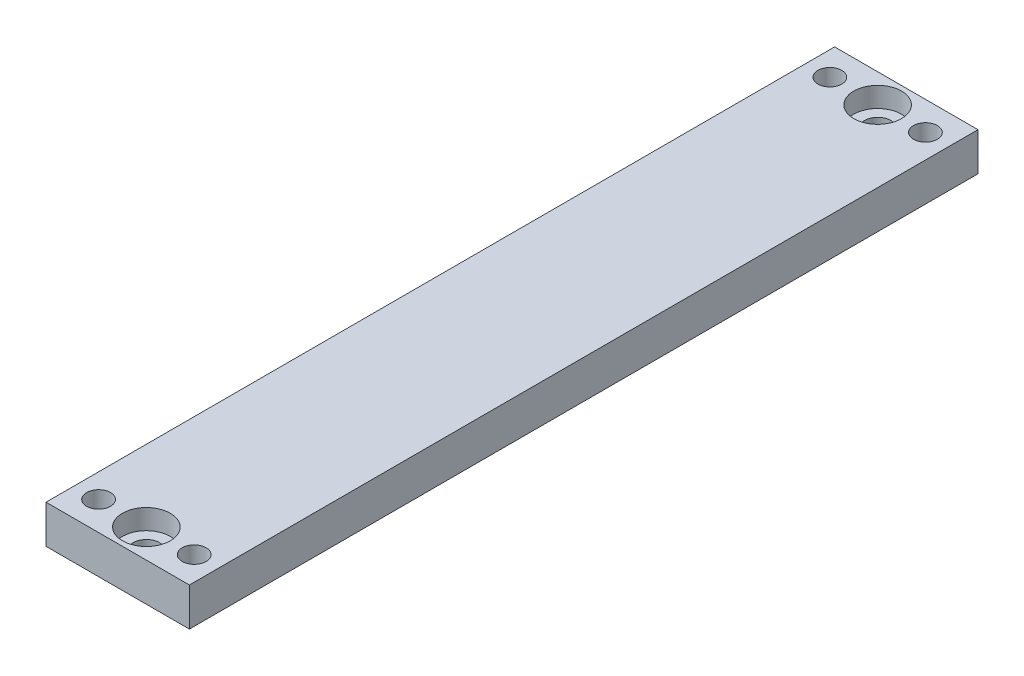
ISO-10303-21;
HEADER;
FILE_DESCRIPTION(('STEP AP214'),'2;1');
FILE_NAME('part.step','',(''),(''),'','','');
FILE_SCHEMA(('AUTOMOTIVE_DESIGN { 1 0 10303 214 1 1 1 1 }'));
ENDSEC;
DATA;
#1=APPLICATION_CONTEXT('core data for automotive mechanical design processes');
#2=APPLICATION_PROTOCOL_DEFINITION('international standard','automotive_design',2000,#1);
#3=PRODUCT_CONTEXT('',#1,'mechanical');
#4=PRODUCT('Part','Part','',(#3));
#5=PRODUCT_RELATED_PRODUCT_CATEGORY('part','',(#4));
#6=PRODUCT_DEFINITION_FORMATION('','',#4);
#7=PRODUCT_DEFINITION_CONTEXT('part definition',#1,'design');
#8=PRODUCT_DEFINITION('design','',#6,#7);
#9=PRODUCT_DEFINITION_SHAPE('','',#8);
#10=(LENGTH_UNIT() NAMED_UNIT(*) SI_UNIT(.MILLI.,.METRE.));
#11=(NAMED_UNIT(*) PLANE_ANGLE_UNIT() SI_UNIT($,.RADIAN.));
#12=(NAMED_UNIT(*) SI_UNIT($,.STERADIAN.) SOLID_ANGLE_UNIT());
#13=UNCERTAINTY_MEASURE_WITH_UNIT(LENGTH_MEASURE(1.E-05),#10,'distance_accuracy_value','');
#14=(GEOMETRIC_REPRESENTATION_CONTEXT(3) GLOBAL_UNCERTAINTY_ASSIGNED_CONTEXT((#13)) GLOBAL_UNIT_ASSIGNED_CONTEXT((#10,
#11,#12)) REPRESENTATION_CONTEXT('',''));
#15=CARTESIAN_POINT('',(0.,0.,0.));
#16=DIRECTION('',(0.,0.,1.));
#17=DIRECTION('',(1.,0.,0.));
#18=AXIS2_PLACEMENT_3D('',#15,#16,#17);
#19=CARTESIAN_POINT('',(0.,0.,-76.5));
#20=DIRECTION('',(0.,1.,0.));
#21=DIRECTION('',(0.,0.,1.));
#22=AXIS2_PLACEMENT_3D('',#19,#20,#21);
#23=CYLINDRICAL_SURFACE('',#22,2.75);
#24=CARTESIAN_POINT('',(0.,0.,-76.5));
#25=DIRECTION('',(0.,1.,0.));
#26=DIRECTION('',(0.,0.,1.));
#27=AXIS2_PLACEMENT_3D('',#24,#25,#26);
#28=CIRCLE('',#27,2.75);
#29=CARTESIAN_POINT('',(0.,0.,-73.75));
#30=VERTEX_POINT('',#29);
#31=EDGE_CURVE('E116',#30,#30,#28,.T.);
#32=ORIENTED_EDGE('',*,*,#31,.F.);
#33=EDGE_LOOP('',(#32));
#34=FACE_BOUND('',#33,.T.);
#35=CARTESIAN_POINT('',(0.,3.8,-76.5));
#36=DIRECTION('',(0.,1.,0.));
#37=DIRECTION('',(0.,0.,1.));
#38=AXIS2_PLACEMENT_3D('',#35,#36,#37);
#39=CIRCLE('',#38,2.75);
#40=CARTESIAN_POINT('',(0.,3.8,-73.75));
#41=VERTEX_POINT('',#40);
#42=EDGE_CURVE('E112',#41,#41,#39,.F.);
#43=ORIENTED_EDGE('',*,*,#42,.F.);
#44=EDGE_LOOP('',(#43));
#45=FACE_BOUND('',#44,.T.);
#46=ADVANCED_FACE('F33',(#34,#45),#23,.F.);
#47=CARTESIAN_POINT('',(0.,0.,76.5));
#48=DIRECTION('',(0.,1.,0.));
#49=DIRECTION('',(0.,0.,1.));
#50=AXIS2_PLACEMENT_3D('',#47,#48,#49);
#51=CYLINDRICAL_SURFACE('',#50,2.75);
#52=CARTESIAN_POINT('',(0.,0.,76.5));
#53=DIRECTION('',(0.,1.,0.));
#54=DIRECTION('',(0.,0.,1.));
#55=AXIS2_PLACEMENT_3D('',#52,#53,#54);
#56=CIRCLE('',#55,2.75);
#57=CARTESIAN_POINT('',(0.,0.,79.25));
#58=VERTEX_POINT('',#57);
#59=EDGE_CURVE('E103',#58,#58,#56,.T.);
#60=ORIENTED_EDGE('',*,*,#59,.F.);
#61=EDGE_LOOP('',(#60));
#62=FACE_BOUND('',#61,.T.);
#63=CARTESIAN_POINT('',(0.,3.8,76.5));
#64=DIRECTION('',(0.,1.,0.));
#65=DIRECTION('',(0.,0.,1.));
#66=AXIS2_PLACEMENT_3D('',#63,#64,#65);
#67=CIRCLE('',#66,2.75);
#68=CARTESIAN_POINT('',(0.,3.8,79.25));
#69=VERTEX_POINT('',#68);
#70=EDGE_CURVE('E109',#69,#69,#67,.F.);
#71=ORIENTED_EDGE('',*,*,#70,.F.);
#72=EDGE_LOOP('',(#71));
#73=FACE_BOUND('',#72,.T.);
#74=ADVANCED_FACE('F151',(#62,#73),#51,.F.);
#75=CARTESIAN_POINT('',(15.,8.,-82.5));
#76=DIRECTION('',(-1.,0.,0.));
#77=DIRECTION('',(0.,0.,1.));
#78=AXIS2_PLACEMENT_3D('',#75,#76,#77);
#79=PLANE('',#78);
#80=DIRECTION('',(0.,0.,-1.));
#81=VECTOR('',#80,1.);
#82=CARTESIAN_POINT('',(15.,0.,-82.5));
#83=LINE('',#82,#81);
#84=CARTESIAN_POINT('',(15.,0.,82.5));
#85=VERTEX_POINT('',#84);
#86=CARTESIAN_POINT('',(15.,0.,-82.5));
#87=VERTEX_POINT('',#86);
#88=EDGE_CURVE('E100',#85,#87,#83,.T.);
#89=ORIENTED_EDGE('',*,*,#88,.T.);
#90=DIRECTION('',(0.,-1.,0.));
#91=VECTOR('',#90,1.);
#92=CARTESIAN_POINT('',(15.,8.,-82.5));
#93=LINE('',#92,#91);
#94=CARTESIAN_POINT('',(15.,8.,-82.5));
#95=VERTEX_POINT('',#94);
#96=EDGE_CURVE('E11',#95,#87,#93,.T.);
#97=ORIENTED_EDGE('',*,*,#96,.F.);
#98=DIRECTION('',(0.,0.,-1.));
#99=VECTOR('',#98,1.);
#100=CARTESIAN_POINT('',(15.,8.,-82.5));
#101=LINE('',#100,#99);
#102=CARTESIAN_POINT('',(15.,8.,82.5));
#103=VERTEX_POINT('',#102);
#104=EDGE_CURVE('E87',#103,#95,#101,.T.);
#105=ORIENTED_EDGE('',*,*,#104,.F.);
#106=DIRECTION('',(0.,-1.,0.));
#107=VECTOR('',#106,1.);
#108=CARTESIAN_POINT('',(15.,8.,82.5));
#109=LINE('',#108,#107);
#110=EDGE_CURVE('E96',#103,#85,#109,.T.);
#111=ORIENTED_EDGE('',*,*,#110,.T.);
#112=EDGE_LOOP('',(#89,#97,#105,#111));
#113=FACE_BOUND('',#112,.T.);
#114=ADVANCED_FACE('F35',(#113),#79,.F.);
#115=CARTESIAN_POINT('',(-15.,8.,-82.5));
#116=DIRECTION('',(0.,0.,1.));
#117=DIRECTION('',(1.,0.,0.));
#118=AXIS2_PLACEMENT_3D('',#115,#116,#117);
#119=PLANE('',#118);
#120=DIRECTION('',(-1.,0.,0.));
#121=VECTOR('',#120,1.);
#122=CARTESIAN_POINT('',(-15.,0.,-82.5));
#123=LINE('',#122,#121);
#124=CARTESIAN_POINT('',(-15.,0.,-82.5));
#125=VERTEX_POINT('',#124);
#126=EDGE_CURVE('E91',#87,#125,#123,.T.);
#127=ORIENTED_EDGE('',*,*,#126,.T.);
#128=DIRECTION('',(0.,-1.,0.));
#129=VECTOR('',#128,1.);
#130=CARTESIAN_POINT('',(-15.,8.,-82.5));
#131=LINE('',#130,#129);
#132=CARTESIAN_POINT('',(-15.,8.,-82.5));
#133=VERTEX_POINT('',#132);
#134=EDGE_CURVE('E43',#133,#125,#131,.T.);
#135=ORIENTED_EDGE('',*,*,#134,.F.);
#136=DIRECTION('',(-1.,0.,0.));
#137=VECTOR('',#136,1.);
#138=CARTESIAN_POINT('',(-15.,8.,-82.5));
#139=LINE('',#138,#137);
#140=EDGE_CURVE('E82',#95,#133,#139,.T.);
#141=ORIENTED_EDGE('',*,*,#140,.F.);
#142=ORIENTED_EDGE('',*,*,#96,.T.);
#143=EDGE_LOOP('',(#127,#135,#141,#142));
#144=FACE_BOUND('',#143,.T.);
#145=ADVANCED_FACE('F90',(#144),#119,.F.);
#146=CARTESIAN_POINT('',(-15.,8.,-82.5));
#147=DIRECTION('',(1.,0.,0.));
#148=DIRECTION('',(0.,0.,-1.));
#149=AXIS2_PLACEMENT_3D('',#146,#147,#148);
#150=PLANE('',#149);
#151=DIRECTION('',(0.,0.,1.));
#152=VECTOR('',#151,1.);
#153=CARTESIAN_POINT('',(-15.,0.,-82.5));
#154=LINE('',#153,#152);
#155=CARTESIAN_POINT('',(-15.,0.,82.5));
#156=VERTEX_POINT('',#155);
#157=EDGE_CURVE('E69',#125,#156,#154,.T.);
#158=ORIENTED_EDGE('',*,*,#157,.T.);
#159=DIRECTION('',(0.,-1.,0.));
#160=VECTOR('',#159,1.);
#161=CARTESIAN_POINT('',(-15.,8.,82.5));
#162=LINE('',#161,#160);
#163=CARTESIAN_POINT('',(-15.,8.,82.5));
#164=VERTEX_POINT('',#163);
#165=EDGE_CURVE('E92',#164,#156,#162,.T.);
#166=ORIENTED_EDGE('',*,*,#165,.F.);
#167=DIRECTION('',(0.,0.,1.));
#168=VECTOR('',#167,1.);
#169=CARTESIAN_POINT('',(-15.,8.,-82.5));
#170=LINE('',#169,#168);
#171=EDGE_CURVE('E85',#133,#164,#170,.T.);
#172=ORIENTED_EDGE('',*,*,#171,.F.);
#173=ORIENTED_EDGE('',*,*,#134,.T.);
#174=EDGE_LOOP('',(#158,#166,#172,#173));
#175=FACE_BOUND('',#174,.T.);
#176=ADVANCED_FACE('F94',(#175),#150,.F.);
#177=CARTESIAN_POINT('',(-15.,8.,82.5));
#178=DIRECTION('',(0.,0.,-1.));
#179=DIRECTION('',(-1.,0.,0.));
#180=AXIS2_PLACEMENT_3D('',#177,#178,#179);
#181=PLANE('',#180);
#182=DIRECTION('',(1.,0.,0.));
#183=VECTOR('',#182,1.);
#184=CARTESIAN_POINT('',(-15.,0.,82.5));
#185=LINE('',#184,#183);
#186=EDGE_CURVE('E75',#156,#85,#185,.T.);
#187=ORIENTED_EDGE('',*,*,#186,.T.);
#188=ORIENTED_EDGE('',*,*,#110,.F.);
#189=DIRECTION('',(1.,0.,0.));
#190=VECTOR('',#189,1.);
#191=CARTESIAN_POINT('',(-15.,8.,82.5));
#192=LINE('',#191,#190);
#193=EDGE_CURVE('E52',#164,#103,#192,.T.);
#194=ORIENTED_EDGE('',*,*,#193,.F.);
#195=ORIENTED_EDGE('',*,*,#165,.T.);
#196=EDGE_LOOP('',(#187,#188,#194,#195));
#197=FACE_BOUND('',#196,.T.);
#198=ADVANCED_FACE('F183',(#197),#181,.F.);
#199=CARTESIAN_POINT('',(0.,8.,0.));
#200=DIRECTION('',(0.,1.,0.));
#201=DIRECTION('',(0.,0.,1.));
#202=AXIS2_PLACEMENT_3D('',#199,#200,#201);
#203=PLANE('',#202);
#204=CARTESIAN_POINT('',(10.,8.,-76.5));
#205=DIRECTION('',(0.,1.,0.));
#206=DIRECTION('',(0.,0.,1.));
#207=AXIS2_PLACEMENT_3D('',#204,#205,#206);
#208=CIRCLE('',#207,2.5);
#209=CARTESIAN_POINT('',(10.,8.,-74.));
#210=VERTEX_POINT('',#209);
#211=EDGE_CURVE('E296',#210,#210,#208,.T.);
#212=ORIENTED_EDGE('',*,*,#211,.F.);
#213=EDGE_LOOP('',(#212));
#214=FACE_BOUND('',#213,.T.);
#215=CARTESIAN_POINT('',(-10.,8.,76.5));
#216=DIRECTION('',(0.,1.,0.));
#217=DIRECTION('',(0.,0.,1.));
#218=AXIS2_PLACEMENT_3D('',#215,#216,#217);
#219=CIRCLE('',#218,2.5);
#220=CARTESIAN_POINT('',(-10.,8.,79.));
#221=VERTEX_POINT('',#220);
#222=EDGE_CURVE('E297',#221,#221,#219,.T.);
#223=ORIENTED_EDGE('',*,*,#222,.F.);
#224=EDGE_LOOP('',(#223));
#225=FACE_BOUND('',#224,.T.);
#226=CARTESIAN_POINT('',(10.,8.,76.5));
#227=DIRECTION('',(0.,1.,0.));
#228=DIRECTION('',(0.,0.,1.));
#229=AXIS2_PLACEMENT_3D('',#226,#227,#228);
#230=CIRCLE('',#229,2.5);
#231=CARTESIAN_POINT('',(10.,8.,79.));
#232=VERTEX_POINT('',#231);
#233=EDGE_CURVE('E302',#232,#232,#230,.T.);
#234=ORIENTED_EDGE('',*,*,#233,.F.);
#235=EDGE_LOOP('',(#234));
#236=FACE_BOUND('',#235,.T.);
#237=CARTESIAN_POINT('',(-10.,8.,-76.5));
#238=DIRECTION('',(0.,1.,0.));
#239=DIRECTION('',(0.,0.,1.));
#240=AXIS2_PLACEMENT_3D('',#237,#238,#239);
#241=CIRCLE('',#240,2.5);
#242=CARTESIAN_POINT('',(-10.,8.,-74.));
#243=VERTEX_POINT('',#242);
#244=EDGE_CURVE('E121',#243,#243,#241,.T.);
#245=ORIENTED_EDGE('',*,*,#244,.F.);
#246=EDGE_LOOP('',(#245));
#247=FACE_BOUND('',#246,.T.);
#248=CARTESIAN_POINT('',(0.,8.,-76.5));
#249=DIRECTION('',(0.,1.,0.));
#250=DIRECTION('',(0.,0.,1.));
#251=AXIS2_PLACEMENT_3D('',#248,#249,#250);
#252=CIRCLE('',#251,5.);
#253=CARTESIAN_POINT('',(0.,8.,-71.5));
#254=VERTEX_POINT('',#253);
#255=EDGE_CURVE('E137',#254,#254,#252,.T.);
#256=ORIENTED_EDGE('',*,*,#255,.F.);
#257=EDGE_LOOP('',(#256));
#258=FACE_BOUND('',#257,.T.);
#259=CARTESIAN_POINT('',(0.,8.,76.5));
#260=DIRECTION('',(0.,1.,0.));
#261=DIRECTION('',(0.,0.,1.));
#262=AXIS2_PLACEMENT_3D('',#259,#260,#261);
#263=CIRCLE('',#262,5.);
#264=CARTESIAN_POINT('',(0.,8.,81.5));
#265=VERTEX_POINT('',#264);
#266=EDGE_CURVE('E128',#265,#265,#263,.T.);
#267=ORIENTED_EDGE('',*,*,#266,.F.);
#268=EDGE_LOOP('',(#267));
#269=FACE_BOUND('',#268,.T.);
#270=ORIENTED_EDGE('',*,*,#104,.T.);
#271=ORIENTED_EDGE('',*,*,#140,.T.);
#272=ORIENTED_EDGE('',*,*,#171,.T.);
#273=ORIENTED_EDGE('',*,*,#193,.T.);
#274=EDGE_LOOP('',(#270,#271,#272,#273));
#275=FACE_BOUND('',#274,.T.);
#276=ADVANCED_FACE('F83',(#214,#225,#236,#247,#258,#269,#275),#203,.T.);
#277=CARTESIAN_POINT('',(0.,0.,0.));
#278=DIRECTION('',(0.,1.,0.));
#279=DIRECTION('',(0.,0.,1.));
#280=AXIS2_PLACEMENT_3D('',#277,#278,#279);
#281=PLANE('',#280);
#282=CARTESIAN_POINT('',(10.,0.,-76.5));
#283=DIRECTION('',(0.,1.,0.));
#284=DIRECTION('',(0.,0.,1.));
#285=AXIS2_PLACEMENT_3D('',#282,#283,#284);
#286=CIRCLE('',#285,2.5);
#287=CARTESIAN_POINT('',(10.,0.,-74.));
#288=VERTEX_POINT('',#287);
#289=EDGE_CURVE('E37',#288,#288,#286,.T.);
#290=ORIENTED_EDGE('',*,*,#289,.T.);
#291=EDGE_LOOP('',(#290));
#292=FACE_BOUND('',#291,.T.);
#293=CARTESIAN_POINT('',(-10.,0.,76.5));
#294=DIRECTION('',(0.,1.,0.));
#295=DIRECTION('',(0.,0.,1.));
#296=AXIS2_PLACEMENT_3D('',#293,#294,#295);
#297=CIRCLE('',#296,2.5);
#298=CARTESIAN_POINT('',(-10.,0.,79.));
#299=VERTEX_POINT('',#298);
#300=EDGE_CURVE('E123',#299,#299,#297,.T.);
#301=ORIENTED_EDGE('',*,*,#300,.T.);
#302=EDGE_LOOP('',(#301));
#303=FACE_BOUND('',#302,.T.);
#304=CARTESIAN_POINT('',(10.,0.,76.5));
#305=DIRECTION('',(0.,1.,0.));
#306=DIRECTION('',(0.,0.,1.));
#307=AXIS2_PLACEMENT_3D('',#304,#305,#306);
#308=CIRCLE('',#307,2.5);
#309=CARTESIAN_POINT('',(10.,0.,79.));
#310=VERTEX_POINT('',#309);
#311=EDGE_CURVE('E120',#310,#310,#308,.T.);
#312=ORIENTED_EDGE('',*,*,#311,.T.);
#313=EDGE_LOOP('',(#312));
#314=FACE_BOUND('',#313,.T.);
#315=CARTESIAN_POINT('',(-10.,0.,-76.5));
#316=DIRECTION('',(0.,1.,0.));
#317=DIRECTION('',(0.,0.,1.));
#318=AXIS2_PLACEMENT_3D('',#315,#316,#317);
#319=CIRCLE('',#318,2.5);
#320=CARTESIAN_POINT('',(-10.,0.,-74.));
#321=VERTEX_POINT('',#320);
#322=EDGE_CURVE('E117',#321,#321,#319,.T.);
#323=ORIENTED_EDGE('',*,*,#322,.T.);
#324=EDGE_LOOP('',(#323));
#325=FACE_BOUND('',#324,.T.);
#326=ORIENTED_EDGE('',*,*,#59,.T.);
#327=EDGE_LOOP('',(#326));
#328=FACE_BOUND('',#327,.T.);
#329=ORIENTED_EDGE('',*,*,#31,.T.);
#330=EDGE_LOOP('',(#329));
#331=FACE_BOUND('',#330,.T.);
#332=ORIENTED_EDGE('',*,*,#88,.F.);
#333=ORIENTED_EDGE('',*,*,#186,.F.);
#334=ORIENTED_EDGE('',*,*,#157,.F.);
#335=ORIENTED_EDGE('',*,*,#126,.F.);
#336=EDGE_LOOP('',(#332,#333,#334,#335));
#337=FACE_BOUND('',#336,.T.);
#338=ADVANCED_FACE('F146',(#292,#303,#314,#325,#328,#331,#337),#281,.F.);
#339=CARTESIAN_POINT('',(0.,3.8,76.5));
#340=DIRECTION('',(0.,1.,0.));
#341=DIRECTION('',(0.,0.,1.));
#342=AXIS2_PLACEMENT_3D('',#339,#340,#341);
#343=PLANE('',#342);
#344=CARTESIAN_POINT('',(0.,3.8,76.5));
#345=DIRECTION('',(0.,1.,0.));
#346=DIRECTION('',(0.,0.,1.));
#347=AXIS2_PLACEMENT_3D('',#344,#345,#346);
#348=CIRCLE('',#347,5.);
#349=CARTESIAN_POINT('',(0.,3.8,81.5));
#350=VERTEX_POINT('',#349);
#351=EDGE_CURVE('E132',#350,#350,#348,.T.);
#352=ORIENTED_EDGE('',*,*,#351,.T.);
#353=EDGE_LOOP('',(#352));
#354=FACE_BOUND('',#353,.T.);
#355=ORIENTED_EDGE('',*,*,#70,.T.);
#356=EDGE_LOOP('',(#355));
#357=FACE_BOUND('',#356,.T.);
#358=ADVANCED_FACE('F168',(#354,#357),#343,.T.);
#359=CARTESIAN_POINT('',(0.,3.8,76.5));
#360=DIRECTION('',(0.,1.,0.));
#361=DIRECTION('',(0.,0.,1.));
#362=AXIS2_PLACEMENT_3D('',#359,#360,#361);
#363=CYLINDRICAL_SURFACE('',#362,5.);
#364=ORIENTED_EDGE('',*,*,#351,.F.);
#365=EDGE_LOOP('',(#364));
#366=FACE_BOUND('',#365,.T.);
#367=ORIENTED_EDGE('',*,*,#266,.T.);
#368=EDGE_LOOP('',(#367));
#369=FACE_BOUND('',#368,.T.);
#370=ADVANCED_FACE('F158',(#366,#369),#363,.F.);
#371=CARTESIAN_POINT('',(0.,3.8,-76.5));
#372=DIRECTION('',(0.,1.,0.));
#373=DIRECTION('',(0.,0.,1.));
#374=AXIS2_PLACEMENT_3D('',#371,#372,#373);
#375=PLANE('',#374);
#376=CARTESIAN_POINT('',(0.,3.8,-76.5));
#377=DIRECTION('',(0.,1.,0.));
#378=DIRECTION('',(0.,0.,1.));
#379=AXIS2_PLACEMENT_3D('',#376,#377,#378);
#380=CIRCLE('',#379,5.);
#381=CARTESIAN_POINT('',(0.,3.8,-71.5));
#382=VERTEX_POINT('',#381);
#383=EDGE_CURVE('E113',#382,#382,#380,.T.);
#384=ORIENTED_EDGE('',*,*,#383,.T.);
#385=EDGE_LOOP('',(#384));
#386=FACE_BOUND('',#385,.T.);
#387=ORIENTED_EDGE('',*,*,#42,.T.);
#388=EDGE_LOOP('',(#387));
#389=FACE_BOUND('',#388,.T.);
#390=ADVANCED_FACE('F155',(#386,#389),#375,.T.);
#391=CARTESIAN_POINT('',(0.,3.8,-76.5));
#392=DIRECTION('',(0.,1.,0.));
#393=DIRECTION('',(0.,0.,1.));
#394=AXIS2_PLACEMENT_3D('',#391,#392,#393);
#395=CYLINDRICAL_SURFACE('',#394,5.);
#396=ORIENTED_EDGE('',*,*,#383,.F.);
#397=EDGE_LOOP('',(#396));
#398=FACE_BOUND('',#397,.T.);
#399=ORIENTED_EDGE('',*,*,#255,.T.);
#400=EDGE_LOOP('',(#399));
#401=FACE_BOUND('',#400,.T.);
#402=ADVANCED_FACE('F157',(#398,#401),#395,.F.);
#403=CARTESIAN_POINT('',(-10.,-33.2,-76.5));
#404=DIRECTION('',(0.,1.,0.));
#405=DIRECTION('',(0.,0.,1.));
#406=AXIS2_PLACEMENT_3D('',#403,#404,#405);
#407=CYLINDRICAL_SURFACE('',#406,2.5);
#408=ORIENTED_EDGE('',*,*,#244,.T.);
#409=EDGE_LOOP('',(#408));
#410=FACE_BOUND('',#409,.T.);
#411=ORIENTED_EDGE('',*,*,#322,.F.);
#412=EDGE_LOOP('',(#411));
#413=FACE_BOUND('',#412,.T.);
#414=ADVANCED_FACE('F165',(#410,#413),#407,.F.);
#415=CARTESIAN_POINT('',(10.,-33.2,76.5));
#416=DIRECTION('',(0.,1.,0.));
#417=DIRECTION('',(0.,0.,1.));
#418=AXIS2_PLACEMENT_3D('',#415,#416,#417);
#419=CYLINDRICAL_SURFACE('',#418,2.5);
#420=ORIENTED_EDGE('',*,*,#233,.T.);
#421=EDGE_LOOP('',(#420));
#422=FACE_BOUND('',#421,.T.);
#423=ORIENTED_EDGE('',*,*,#311,.F.);
#424=EDGE_LOOP('',(#423));
#425=FACE_BOUND('',#424,.T.);
#426=ADVANCED_FACE('F261',(#422,#425),#419,.F.);
#427=CARTESIAN_POINT('',(-10.,-33.2,76.5));
#428=DIRECTION('',(0.,1.,0.));
#429=DIRECTION('',(0.,0.,1.));
#430=AXIS2_PLACEMENT_3D('',#427,#428,#429);
#431=CYLINDRICAL_SURFACE('',#430,2.5);
#432=ORIENTED_EDGE('',*,*,#222,.T.);
#433=EDGE_LOOP('',(#432));
#434=FACE_BOUND('',#433,.T.);
#435=ORIENTED_EDGE('',*,*,#300,.F.);
#436=EDGE_LOOP('',(#435));
#437=FACE_BOUND('',#436,.T.);
#438=ADVANCED_FACE('F267',(#434,#437),#431,.F.);
#439=CARTESIAN_POINT('',(10.,-33.2,-76.5));
#440=DIRECTION('',(0.,1.,0.));
#441=DIRECTION('',(0.,0.,1.));
#442=AXIS2_PLACEMENT_3D('',#439,#440,#441);
#443=CYLINDRICAL_SURFACE('',#442,2.5);
#444=ORIENTED_EDGE('',*,*,#211,.T.);
#445=EDGE_LOOP('',(#444));
#446=FACE_BOUND('',#445,.T.);
#447=ORIENTED_EDGE('',*,*,#289,.F.);
#448=EDGE_LOOP('',(#447));
#449=FACE_BOUND('',#448,.T.);
#450=ADVANCED_FACE('F275',(#446,#449),#443,.F.);
#451=CLOSED_SHELL('',(#46,#74,#114,#145,#176,#198,#276,#338,#358,#370,#390,#402,#414,#426,#438,#450));
#452=MANIFOLD_SOLID_BREP('B2',#451);
#453=ADVANCED_BREP_SHAPE_REPRESENTATION('',(#18,#452),#14);
#454=SHAPE_DEFINITION_REPRESENTATION(#9,#453);
ENDSEC;
END-ISO-10303-21;
